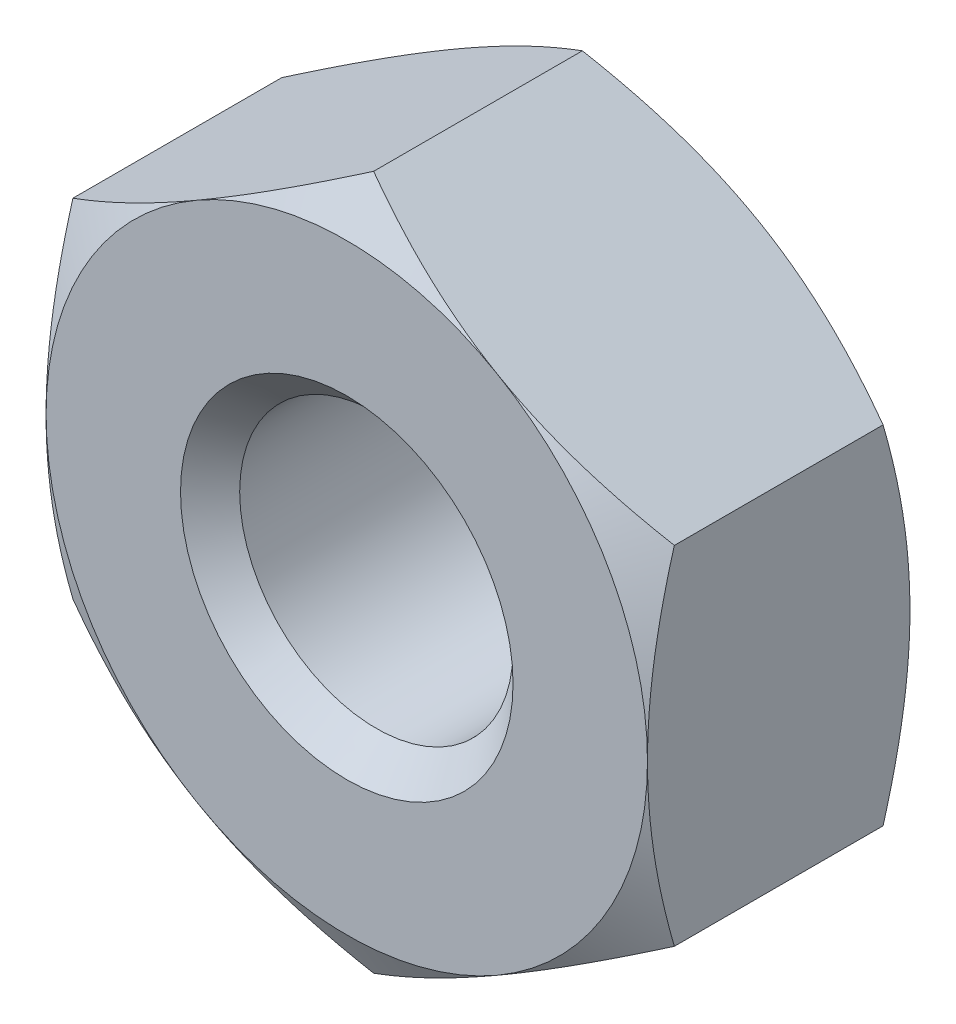
ISO-10303-21;
HEADER;
FILE_DESCRIPTION(('STEP AP214'),'2;1');
FILE_NAME('part.step','',(''),(''),'','','');
FILE_SCHEMA(('AUTOMOTIVE_DESIGN { 1 0 10303 214 1 1 1 1 }'));
ENDSEC;
DATA;
#1=APPLICATION_CONTEXT('core data for automotive mechanical design processes');
#2=APPLICATION_PROTOCOL_DEFINITION('international standard','automotive_design',2000,#1);
#3=PRODUCT_CONTEXT('',#1,'mechanical');
#4=PRODUCT('Part','Part','',(#3));
#5=PRODUCT_RELATED_PRODUCT_CATEGORY('part','',(#4));
#6=PRODUCT_DEFINITION_FORMATION('','',#4);
#7=PRODUCT_DEFINITION_CONTEXT('part definition',#1,'design');
#8=PRODUCT_DEFINITION('design','',#6,#7);
#9=PRODUCT_DEFINITION_SHAPE('','',#8);
#10=(LENGTH_UNIT() NAMED_UNIT(*) SI_UNIT(.MILLI.,.METRE.));
#11=(NAMED_UNIT(*) PLANE_ANGLE_UNIT() SI_UNIT($,.RADIAN.));
#12=(NAMED_UNIT(*) SI_UNIT($,.STERADIAN.) SOLID_ANGLE_UNIT());
#13=UNCERTAINTY_MEASURE_WITH_UNIT(LENGTH_MEASURE(1.E-05),#10,'distance_accuracy_value','');
#14=(GEOMETRIC_REPRESENTATION_CONTEXT(3) GLOBAL_UNCERTAINTY_ASSIGNED_CONTEXT((#13)) GLOBAL_UNIT_ASSIGNED_CONTEXT((#10,
#11,#12)) REPRESENTATION_CONTEXT('',''));
#15=CARTESIAN_POINT('',(0.,0.,0.));
#16=DIRECTION('',(0.,0.,1.));
#17=DIRECTION('',(1.,0.,0.));
#18=AXIS2_PLACEMENT_3D('',#15,#16,#17);
#19=CARTESIAN_POINT('',(0.,3.17542648054294,1.2));
#20=DIRECTION('',(0.5,-0.866025403784439,0.));
#21=DIRECTION('',(0.866025403784439,0.5,0.));
#22=AXIS2_PLACEMENT_3D('',#19,#20,#21);
#23=PLANE('',#22);
#24=CARTESIAN_POINT('',(0.000200000000000067,3.17554195059678,0.954313236635245));
#25=CARTESIAN_POINT('',(-0.120649220659906,3.10576962051743,0.994612337750741));
#26=CARTESIAN_POINT('',(-0.242541602622633,3.03539502097908,1.03126309740234));
#27=CARTESIAN_POINT('',(-0.488437126727892,2.89342717394439,1.0952378170302));
#28=CARTESIAN_POINT('',(-0.612444638573855,2.82183140359858,1.12253914432551));
#29=CARTESIAN_POINT('',(-0.858922797975943,2.67952717191842,1.16503825470589));
#30=CARTESIAN_POINT('',(-0.981355518587416,2.60884060771577,1.18051888137754));
#31=CARTESIAN_POINT('',(-1.22679714236891,2.46713482015519,1.19900060263006));
#32=CARTESIAN_POINT('',(-1.34980515323291,2.39611611197038,1.2020170005374));
#33=CARTESIAN_POINT('',(-1.57965878661079,2.26341005486544,1.19574685457145));
#34=CARTESIAN_POINT('',(-1.68653879125402,2.20170285541369,1.1879998457233));
#35=CARTESIAN_POINT('',(-1.89960246733475,2.07869048467395,1.16344481893565));
#36=CARTESIAN_POINT('',(-2.00578540164889,2.01738573896433,1.14662841034943));
#37=CARTESIAN_POINT('',(-2.21928848939318,1.89411967378235,1.10458807765405));
#38=CARTESIAN_POINT('',(-2.32658161614286,1.83217395817123,1.07918591931277));
#39=CARTESIAN_POINT('',(-2.53956747928405,1.70920651275308,1.02153277416002));
#40=CARTESIAN_POINT('',(-2.64526294502665,1.64818320715446,0.98929533670102));
#41=CARTESIAN_POINT('',(-2.7502,1.58759777021763,0.954313236635243));
#42=B_SPLINE_CURVE_WITH_KNOTS('',3,(#24,#25,#26,#27,#28,#29,#30,#31,#32,#33,#34,#35,#36,#37,#38,
#39,#40,#41),.UNSPECIFIED.,.F.,.F.,(4,2,2,2,2,2,2,2,4),(0.,0.435912828725888,0.872873557116331,
1.29901931904671,1.72464171213573,2.09526089052937,2.46622354066374,2.84541551798557,
3.22386274754524),.UNSPECIFIED.);
#43=CARTESIAN_POINT('',(0.,3.17542648054294,0.954379906938143));
#44=VERTEX_POINT('',#43);
#45=CARTESIAN_POINT('',(-1.375,2.38156986040721,1.2));
#46=VERTEX_POINT('',#45);
#47=EDGE_CURVE('E125',#44,#46,#42,.T.);
#48=ORIENTED_EDGE('',*,*,#47,.F.);
#49=DIRECTION('',(0.,0.,-1.));
#50=VECTOR('',#49,1.);
#51=CARTESIAN_POINT('',(0.,3.17542648054294,1.2));
#52=LINE('',#51,#50);
#53=CARTESIAN_POINT('',(0.,3.17542648054294,-0.954379906938143));
#54=VERTEX_POINT('',#53);
#55=EDGE_CURVE('E239',#44,#54,#52,.T.);
#56=ORIENTED_EDGE('',*,*,#55,.T.);
#57=CARTESIAN_POINT('',(-2.7502,1.58759777021763,-0.954313236635243));
#58=CARTESIAN_POINT('',(-2.6293507793401,1.65737010029699,-0.99461233775074));
#59=CARTESIAN_POINT('',(-2.50745839737737,1.72774469983533,-1.03126309740234));
#60=CARTESIAN_POINT('',(-2.26156287327211,1.86971254687003,-1.0952378170302));
#61=CARTESIAN_POINT('',(-2.13755536142615,1.94130831721583,-1.1225391443255));
#62=CARTESIAN_POINT('',(-1.89107720202406,2.08361254889599,-1.16503825470588));
#63=CARTESIAN_POINT('',(-1.76864448141259,2.15429911309864,-1.18051888137754));
#64=CARTESIAN_POINT('',(-1.52320285763109,2.29600490065923,-1.19900060263006));
#65=CARTESIAN_POINT('',(-1.40019484676709,2.36702360884404,-1.2020170005374));
#66=CARTESIAN_POINT('',(-1.17034121338921,2.49972966594897,-1.19574685457146));
#67=CARTESIAN_POINT('',(-1.06346120874598,2.56143686540072,-1.1879998457233));
#68=CARTESIAN_POINT('',(-0.850397532665252,2.68444923614046,-1.16344481893565));
#69=CARTESIAN_POINT('',(-0.744214598351113,2.74575398185008,-1.14662841034943));
#70=CARTESIAN_POINT('',(-0.530711510606817,2.86902004703206,-1.10458807765405));
#71=CARTESIAN_POINT('',(-0.423418383857146,2.93096576264318,-1.07918591931277));
#72=CARTESIAN_POINT('',(-0.210432520715949,3.05393320806134,-1.02153277416002));
#73=CARTESIAN_POINT('',(-0.104737054973348,3.11495651365995,-0.989295336701022));
#74=CARTESIAN_POINT('',(0.000199999999999903,3.17554195059678,-0.954313236635244));
#75=B_SPLINE_CURVE_WITH_KNOTS('',3,(#57,#58,#59,#60,#61,#62,#63,#64,#65,#66,#67,#68,#69,#70,#71,
#72,#73,#74),.UNSPECIFIED.,.F.,.F.,(4,2,2,2,2,2,2,2,4),(0.,0.435912828725888,0.872873557116332,
1.29901931904671,1.72464171213573,2.09526089052937,2.46622354066374,2.84541551798557,
3.22386274754524),.UNSPECIFIED.);
#76=CARTESIAN_POINT('',(-1.375,2.38156986040721,-1.2));
#77=VERTEX_POINT('',#76);
#78=EDGE_CURVE('E278',#77,#54,#75,.T.);
#79=ORIENTED_EDGE('',*,*,#78,.F.);
#80=CARTESIAN_POINT('',(-2.75,1.58771324027147,-0.954379906938141));
#81=VERTEX_POINT('',#80);
#82=EDGE_CURVE('E285',#81,#77,#75,.T.);
#83=ORIENTED_EDGE('',*,*,#82,.F.);
#84=DIRECTION('',(0.,0.,-1.));
#85=VECTOR('',#84,1.);
#86=CARTESIAN_POINT('',(-2.75,1.58771324027147,1.2));
#87=LINE('',#86,#85);
#88=CARTESIAN_POINT('',(-2.75,1.58771324027147,0.954379906938141));
#89=VERTEX_POINT('',#88);
#90=EDGE_CURVE('E153',#89,#81,#87,.T.);
#91=ORIENTED_EDGE('',*,*,#90,.F.);
#92=EDGE_CURVE('E135',#46,#89,#42,.T.);
#93=ORIENTED_EDGE('',*,*,#92,.F.);
#94=EDGE_LOOP('',(#48,#56,#79,#83,#91,#93));
#95=FACE_BOUND('',#94,.T.);
#96=ADVANCED_FACE('F37',(#95),#23,.F.);
#97=CARTESIAN_POINT('',(-2.75,1.58771324027147,1.2));
#98=DIRECTION('',(1.,0.,0.));
#99=DIRECTION('',(0.,0.,-1.));
#100=AXIS2_PLACEMENT_3D('',#97,#98,#99);
#101=PLANE('',#100);
#102=CARTESIAN_POINT('',(-2.75,-4.30390301720192,-0.161076408690709));
#103=CARTESIAN_POINT('',(-2.75,-4.18346183634496,-0.102495462412532));
#104=CARTESIAN_POINT('',(-2.75,-4.0627483469381,-0.0444649946513373));
#105=CARTESIAN_POINT('',(-2.75,-3.82063209362853,0.0701861633604315));
#106=CARTESIAN_POINT('',(-2.75,-3.69922922817248,0.126806638918857));
#107=CARTESIAN_POINT('',(-2.75,-3.45498258352431,0.238605553593725));
#108=CARTESIAN_POINT('',(-2.75,-3.33213458050091,0.293774796098297));
#109=CARTESIAN_POINT('',(-2.75,-3.08547511508691,0.401907353546585));
#110=CARTESIAN_POINT('',(-2.75,-2.9616636973982,0.454870770123538));
#111=CARTESIAN_POINT('',(-2.75,-2.70873002170802,0.559731360532049));
#112=CARTESIAN_POINT('',(-2.75,-2.57956837503753,0.611534033727881));
#113=CARTESIAN_POINT('',(-2.75,-2.31974843728962,0.711312632694245));
#114=CARTESIAN_POINT('',(-2.75,-2.18908998221528,0.759288134467373));
#115=CARTESIAN_POINT('',(-2.75,-1.92630078982448,0.850181497874872));
#116=CARTESIAN_POINT('',(-2.75,-1.79417351465773,0.893109270571312));
#117=CARTESIAN_POINT('',(-2.75,-1.52802381114163,0.972555534531259));
#118=CARTESIAN_POINT('',(-2.75,-1.39400198148718,1.00907600370378));
#119=CARTESIAN_POINT('',(-2.75,-1.1247426051988,1.07378343729295));
#120=CARTESIAN_POINT('',(-2.75,-0.98951651847669,1.10201722216622));
#121=CARTESIAN_POINT('',(-2.75,-0.717342133540144,1.14858513052455));
#122=CARTESIAN_POINT('',(-2.75,-0.580394010714915,1.16692025396294));
#123=CARTESIAN_POINT('',(-2.75,-0.307264223292112,1.19198982834036));
#124=CARTESIAN_POINT('',(-2.75,-0.171096876658298,1.19887642876326));
#125=CARTESIAN_POINT('',(-2.75,0.101336625313081,1.20086815686916));
#126=CARTESIAN_POINT('',(-2.75,0.237602781705956,1.19597315681277));
#127=CARTESIAN_POINT('',(-2.75,0.467797680560964,1.17810232782276));
#128=CARTESIAN_POINT('',(-2.75,0.561967915481139,1.1680452223586));
#129=CARTESIAN_POINT('',(-2.75,0.749642226834777,1.14290982744911));
#130=CARTESIAN_POINT('',(-2.75,0.843146215373774,1.12783088758256));
#131=CARTESIAN_POINT('',(-2.75,1.12250913895018,1.07584910895217));
#132=CARTESIAN_POINT('',(-2.75,1.30711940645803,1.03221009052051));
#133=CARTESIAN_POINT('',(-2.75,1.67667658210268,0.930598702582513));
#134=CARTESIAN_POINT('',(-2.75,1.86153763251216,0.87232596653366));
#135=CARTESIAN_POINT('',(-2.75,2.1362551669383,0.777677043706087));
#136=CARTESIAN_POINT('',(-2.75,2.2273905801987,0.74492404175435));
#137=CARTESIAN_POINT('',(-2.75,2.40890358977874,0.677382180856329));
#138=CARTESIAN_POINT('',(-2.75,2.49928119650105,0.642593349909013));
#139=CARTESIAN_POINT('',(-2.75,2.71825345258565,0.555929422896168));
#140=CARTESIAN_POINT('',(-2.75,2.84649489461499,0.503164300130228));
#141=CARTESIAN_POINT('',(-2.75,3.1018305499463,0.394920499569286));
#142=CARTESIAN_POINT('',(-2.75,3.22892468521528,0.33944163882475));
#143=CARTESIAN_POINT('',(-2.75,3.60884508520057,0.16980731720821));
#144=CARTESIAN_POINT('',(-2.75,3.86025161382976,0.0524776136911526));
#145=CARTESIAN_POINT('',(-2.75,4.36073216273561,-0.187701259786246));
#146=CARTESIAN_POINT('',(-2.75,4.60980322815241,-0.310556513491473));
#147=CARTESIAN_POINT('',(-2.75,5.10611636333848,-0.559922515280733));
#148=CARTESIAN_POINT('',(-2.75,5.35335836018192,-0.686433408140724));
#149=CARTESIAN_POINT('',(-2.75,5.82470677893949,-0.930706625425102));
#150=CARTESIAN_POINT('',(-2.75,6.04892545541808,-1.04825313857293));
#151=CARTESIAN_POINT('',(-2.75,6.49653363605935,-1.28493475206167));
#152=CARTESIAN_POINT('',(-2.75,6.71992310596418,-1.40406991712259));
#153=CARTESIAN_POINT('',(-2.75,7.1654482395454,-1.64321658337444));
#154=CARTESIAN_POINT('',(-2.75,7.38758566096615,-1.76322481484964));
#155=CARTESIAN_POINT('',(-2.75,7.83133346602344,-2.00418017005894));
#156=CARTESIAN_POINT('',(-2.75,8.05294388084433,-2.12512723633796));
#157=CARTESIAN_POINT('',(-2.75,8.27436218409939,-2.24642255294576));
#158=B_SPLINE_CURVE_WITH_KNOTS('',3,(#102,#103,#104,#105,#106,#107,#108,#109,#110,#111,#112,
#113,#114,#115,#116,#117,#118,#119,#120,#121,#122,#123,#124,#125,#126,#127,#128,#129,#130,#131,
#132,#133,#134,#135,#136,#137,#138,#139,#140,#141,#142,#143,#144,#145,#146,#147,#148,#149,#150,
#151,#152,#153,#154,#155,#156,#157),.UNSPECIFIED.,.F.,.F.,(4,2,2,2,2,2,2,2,2,2,2,2,2,2,2,2,2,2,
2,2,2,2,2,2,2,2,2,4),(0.,0.401800999438933,0.803662809496789,1.2076472715733,1.61161309946231,
2.02905420356356,2.44654149029695,2.86319485917833,3.27971938165075,3.69384308413964,
4.10792494441558,4.51645837884831,4.92499624273394,5.20897756068255,5.49299567382162,
6.06133052851013,6.64245100592872,6.93295892589162,7.22346285140748,7.63943779361214,
8.055440817965,8.88763374209439,9.72076650036463,10.5539322989188,11.31341213061,
12.0729229978166,12.8303656683841,13.5877623445881),.UNSPECIFIED.);
#159=CARTESIAN_POINT('',(-2.75,0.,1.2));
#160=VERTEX_POINT('',#159);
#161=EDGE_CURVE('E142',#89,#160,#158,.F.);
#162=ORIENTED_EDGE('',*,*,#161,.F.);
#163=ORIENTED_EDGE('',*,*,#90,.T.);
#164=CARTESIAN_POINT('',(-2.75,-4.30390301720192,0.161076408690709));
#165=CARTESIAN_POINT('',(-2.75,-4.18346183634496,0.102495462412532));
#166=CARTESIAN_POINT('',(-2.75,-4.0627483469381,0.0444649946513373));
#167=CARTESIAN_POINT('',(-2.75,-3.82063209362853,-0.0701861633604315));
#168=CARTESIAN_POINT('',(-2.75,-3.69922922817248,-0.126806638918857));
#169=CARTESIAN_POINT('',(-2.75,-3.45498258352431,-0.238605553593725));
#170=CARTESIAN_POINT('',(-2.75,-3.33213458050091,-0.293774796098297));
#171=CARTESIAN_POINT('',(-2.75,-3.08547511508691,-0.401907353546585));
#172=CARTESIAN_POINT('',(-2.75,-2.9616636973982,-0.454870770123538));
#173=CARTESIAN_POINT('',(-2.75,-2.70873002170802,-0.559731360532049));
#174=CARTESIAN_POINT('',(-2.75,-2.57956837503753,-0.611534033727881));
#175=CARTESIAN_POINT('',(-2.75,-2.31974843728962,-0.711312632694245));
#176=CARTESIAN_POINT('',(-2.75,-2.18908998221528,-0.759288134467373));
#177=CARTESIAN_POINT('',(-2.75,-1.92630078982448,-0.850181497874872));
#178=CARTESIAN_POINT('',(-2.75,-1.79417351465773,-0.893109270571312));
#179=CARTESIAN_POINT('',(-2.75,-1.52802381114163,-0.972555534531259));
#180=CARTESIAN_POINT('',(-2.75,-1.39400198148718,-1.00907600370378));
#181=CARTESIAN_POINT('',(-2.75,-1.1247426051988,-1.07378343729295));
#182=CARTESIAN_POINT('',(-2.75,-0.98951651847669,-1.10201722216622));
#183=CARTESIAN_POINT('',(-2.75,-0.717342133540144,-1.14858513052455));
#184=CARTESIAN_POINT('',(-2.75,-0.580394010714915,-1.16692025396294));
#185=CARTESIAN_POINT('',(-2.75,-0.307264223292112,-1.19198982834036));
#186=CARTESIAN_POINT('',(-2.75,-0.171096876658298,-1.19887642876326));
#187=CARTESIAN_POINT('',(-2.75,0.101336625313081,-1.20086815686916));
#188=CARTESIAN_POINT('',(-2.75,0.237602781705956,-1.19597315681277));
#189=CARTESIAN_POINT('',(-2.75,0.467797680560964,-1.17810232782276));
#190=CARTESIAN_POINT('',(-2.75,0.561967915481139,-1.1680452223586));
#191=CARTESIAN_POINT('',(-2.75,0.749642226834777,-1.14290982744911));
#192=CARTESIAN_POINT('',(-2.75,0.843146215373774,-1.12783088758256));
#193=CARTESIAN_POINT('',(-2.75,1.12250913895018,-1.07584910895217));
#194=CARTESIAN_POINT('',(-2.75,1.30711940645803,-1.03221009052051));
#195=CARTESIAN_POINT('',(-2.75,1.67667658210268,-0.930598702582513));
#196=CARTESIAN_POINT('',(-2.75,1.86153763251216,-0.87232596653366));
#197=CARTESIAN_POINT('',(-2.75,2.1362551669383,-0.777677043706087));
#198=CARTESIAN_POINT('',(-2.75,2.2273905801987,-0.74492404175435));
#199=CARTESIAN_POINT('',(-2.75,2.40890358977874,-0.677382180856329));
#200=CARTESIAN_POINT('',(-2.75,2.49928119650105,-0.642593349909013));
#201=CARTESIAN_POINT('',(-2.75,2.71825345258565,-0.555929422896168));
#202=CARTESIAN_POINT('',(-2.75,2.84649489461499,-0.503164300130228));
#203=CARTESIAN_POINT('',(-2.75,3.1018305499463,-0.394920499569286));
#204=CARTESIAN_POINT('',(-2.75,3.22892468521528,-0.33944163882475));
#205=CARTESIAN_POINT('',(-2.75,3.60884508520057,-0.16980731720821));
#206=CARTESIAN_POINT('',(-2.75,3.86025161382976,-0.0524776136911526));
#207=CARTESIAN_POINT('',(-2.75,4.36073216273561,0.187701259786246));
#208=CARTESIAN_POINT('',(-2.75,4.60980322815241,0.310556513491473));
#209=CARTESIAN_POINT('',(-2.75,5.10611636333848,0.559922515280733));
#210=CARTESIAN_POINT('',(-2.75,5.35335836018192,0.686433408140724));
#211=CARTESIAN_POINT('',(-2.75,5.82470677893949,0.930706625425102));
#212=CARTESIAN_POINT('',(-2.75,6.04892545541808,1.04825313857293));
#213=CARTESIAN_POINT('',(-2.75,6.49653363605935,1.28493475206167));
#214=CARTESIAN_POINT('',(-2.75,6.71992310596418,1.40406991712259));
#215=CARTESIAN_POINT('',(-2.75,7.1654482395454,1.64321658337444));
#216=CARTESIAN_POINT('',(-2.75,7.38758566096615,1.76322481484964));
#217=CARTESIAN_POINT('',(-2.75,7.83133346602344,2.00418017005894));
#218=CARTESIAN_POINT('',(-2.75,8.05294388084433,2.12512723633796));
#219=CARTESIAN_POINT('',(-2.75,8.27436218409939,2.24642255294576));
#220=B_SPLINE_CURVE_WITH_KNOTS('',3,(#164,#165,#166,#167,#168,#169,#170,#171,#172,#173,#174,
#175,#176,#177,#178,#179,#180,#181,#182,#183,#184,#185,#186,#187,#188,#189,#190,#191,#192,#193,
#194,#195,#196,#197,#198,#199,#200,#201,#202,#203,#204,#205,#206,#207,#208,#209,#210,#211,#212,
#213,#214,#215,#216,#217,#218,#219),.UNSPECIFIED.,.F.,.F.,(4,2,2,2,2,2,2,2,2,2,2,2,2,2,2,2,2,2,
2,2,2,2,2,2,2,2,2,4),(0.,0.401800999438933,0.803662809496789,1.2076472715733,1.61161309946231,
2.02905420356356,2.44654149029695,2.86319485917833,3.27971938165075,3.69384308413964,
4.10792494441558,4.51645837884831,4.92499624273394,5.20897756068255,5.49299567382162,
6.06133052851013,6.64245100592872,6.93295892589162,7.22346285140748,7.63943779361214,
8.055440817965,8.88763374209439,9.72076650036463,10.5539322989188,11.31341213061,
12.0729229978166,12.8303656683841,13.5877623445881),.UNSPECIFIED.);
#221=CARTESIAN_POINT('',(-2.75,0.,-1.2));
#222=VERTEX_POINT('',#221);
#223=EDGE_CURVE('E233',#222,#81,#220,.T.);
#224=ORIENTED_EDGE('',*,*,#223,.F.);
#225=CARTESIAN_POINT('',(-2.75,-1.58771324027169,-0.954379906938282));
#226=VERTEX_POINT('',#225);
#227=EDGE_CURVE('E297',#226,#222,#220,.T.);
#228=ORIENTED_EDGE('',*,*,#227,.F.);
#229=DIRECTION('',(0.,0.,-1.));
#230=VECTOR('',#229,1.);
#231=CARTESIAN_POINT('',(-2.75,-1.58771324027147,1.2));
#232=LINE('',#231,#230);
#233=CARTESIAN_POINT('',(-2.75,-1.58771324027147,0.95437990693814));
#234=VERTEX_POINT('',#233);
#235=EDGE_CURVE('E247',#234,#226,#232,.T.);
#236=ORIENTED_EDGE('',*,*,#235,.F.);
#237=EDGE_CURVE('E154',#160,#234,#158,.F.);
#238=ORIENTED_EDGE('',*,*,#237,.F.);
#239=EDGE_LOOP('',(#162,#163,#224,#228,#236,#238));
#240=FACE_BOUND('',#239,.T.);
#241=ADVANCED_FACE('F217',(#240),#101,.F.);
#242=CARTESIAN_POINT('',(-2.75,-1.58771324027147,1.2));
#243=DIRECTION('',(0.5,0.866025403784438,0.));
#244=DIRECTION('',(-0.866025403784439,0.5,0.));
#245=AXIS2_PLACEMENT_3D('',#242,#243,#244);
#246=PLANE('',#245);
#247=CARTESIAN_POINT('',(-2.7502,-1.58759777021764,0.954313236635242));
#248=CARTESIAN_POINT('',(-2.6293507793401,-1.65737010029699,0.994612337750739));
#249=CARTESIAN_POINT('',(-2.50745839737737,-1.72774469983533,1.03126309740234));
#250=CARTESIAN_POINT('',(-2.26156287327211,-1.86971254687003,1.0952378170302));
#251=CARTESIAN_POINT('',(-2.13755536142615,-1.94130831721583,1.1225391443255));
#252=CARTESIAN_POINT('',(-1.89107720202406,-2.08361254889599,1.16503825470588));
#253=CARTESIAN_POINT('',(-1.76864448141259,-2.15429911309864,1.18051888137754));
#254=CARTESIAN_POINT('',(-1.52320285763109,-2.29600490065923,1.19900060263006));
#255=CARTESIAN_POINT('',(-1.40019484676709,-2.36702360884404,1.2020170005374));
#256=CARTESIAN_POINT('',(-1.17034121338921,-2.49972966594897,1.19574685457145));
#257=CARTESIAN_POINT('',(-1.06346120874598,-2.56143686540073,1.1879998457233));
#258=CARTESIAN_POINT('',(-0.850397532665252,-2.68444923614047,1.16344481893564));
#259=CARTESIAN_POINT('',(-0.744214598351113,-2.74575398185008,1.14662841034943));
#260=CARTESIAN_POINT('',(-0.530711510606818,-2.86902004703207,1.10458807765404));
#261=CARTESIAN_POINT('',(-0.423418383857146,-2.93096576264319,1.07918591931277));
#262=CARTESIAN_POINT('',(-0.21043252071595,-3.05393320806134,1.02153277416002));
#263=CARTESIAN_POINT('',(-0.104737054973348,-3.11495651365996,0.989295336701018));
#264=CARTESIAN_POINT('',(0.000199999999999743,-3.17554195059679,0.954313236635241));
#265=B_SPLINE_CURVE_WITH_KNOTS('',3,(#247,#248,#249,#250,#251,#252,#253,#254,#255,#256,#257,
#258,#259,#260,#261,#262,#263,#264),.UNSPECIFIED.,.F.,.F.,(4,2,2,2,2,2,2,2,4),(0.,
0.435912828725888,0.872873557116332,1.29901931904672,1.72464171213574,2.09526089052938,
2.46622354066374,2.84541551798557,3.22386274754525),.UNSPECIFIED.);
#266=CARTESIAN_POINT('',(-1.375,-2.38156986040721,1.2));
#267=VERTEX_POINT('',#266);
#268=EDGE_CURVE('E211',#234,#267,#265,.T.);
#269=ORIENTED_EDGE('',*,*,#268,.F.);
#270=ORIENTED_EDGE('',*,*,#235,.T.);
#271=CARTESIAN_POINT('',(0.000199999999999867,-3.17554195059679,-0.954313236635241));
#272=CARTESIAN_POINT('',(-0.120649220659906,-3.10576962051743,-0.994612337750738));
#273=CARTESIAN_POINT('',(-0.242541602622634,-3.03539502097909,-1.03126309740234));
#274=CARTESIAN_POINT('',(-0.488437126727893,-2.89342717394439,-1.0952378170302));
#275=CARTESIAN_POINT('',(-0.612444638573856,-2.82183140359859,-1.1225391443255));
#276=CARTESIAN_POINT('',(-0.858922797975945,-2.67952717191843,-1.16503825470588));
#277=CARTESIAN_POINT('',(-0.981355518587418,-2.60884060771578,-1.18051888137754));
#278=CARTESIAN_POINT('',(-1.22679714236892,-2.46713482015519,-1.19900060263006));
#279=CARTESIAN_POINT('',(-1.34980515323291,-2.39611611197038,-1.2020170005374));
#280=CARTESIAN_POINT('',(-1.57965878661079,-2.26341005486545,-1.19574685457145));
#281=CARTESIAN_POINT('',(-1.68653879125402,-2.20170285541369,-1.1879998457233));
#282=CARTESIAN_POINT('',(-1.89960246733475,-2.07869048467395,-1.16344481893564));
#283=CARTESIAN_POINT('',(-2.00578540164889,-2.01738573896434,-1.14662841034943));
#284=CARTESIAN_POINT('',(-2.21928848939319,-1.89411967378235,-1.10458807765404));
#285=CARTESIAN_POINT('',(-2.32658161614286,-1.83217395817123,-1.07918591931277));
#286=CARTESIAN_POINT('',(-2.53956747928405,-1.70920651275308,-1.02153277416002));
#287=CARTESIAN_POINT('',(-2.64526294502665,-1.64818320715446,-0.989295336701019));
#288=CARTESIAN_POINT('',(-2.7502,-1.58759777021764,-0.954313236635242));
#289=B_SPLINE_CURVE_WITH_KNOTS('',3,(#271,#272,#273,#274,#275,#276,#277,#278,#279,#280,#281,
#282,#283,#284,#285,#286,#287,#288),.UNSPECIFIED.,.F.,.F.,(4,2,2,2,2,2,2,2,4),(0.,
0.435912828725888,0.872873557116332,1.29901931904672,1.72464171213574,2.09526089052938,
2.46622354066374,2.84541551798557,3.22386274754525),.UNSPECIFIED.);
#290=CARTESIAN_POINT('',(-1.375,-2.38156986040721,-1.2));
#291=VERTEX_POINT('',#290);
#292=EDGE_CURVE('E223',#291,#226,#289,.T.);
#293=ORIENTED_EDGE('',*,*,#292,.F.);
#294=CARTESIAN_POINT('',(0.,-3.17542648054295,-0.954379906938139));
#295=VERTEX_POINT('',#294);
#296=EDGE_CURVE('E231',#295,#291,#289,.T.);
#297=ORIENTED_EDGE('',*,*,#296,.F.);
#298=DIRECTION('',(0.,0.,-1.));
#299=VECTOR('',#298,1.);
#300=CARTESIAN_POINT('',(0.,-3.17542648054295,1.2));
#301=LINE('',#300,#299);
#302=CARTESIAN_POINT('',(0.,-3.17542648054295,0.954379906938139));
#303=VERTEX_POINT('',#302);
#304=EDGE_CURVE('E245',#303,#295,#301,.T.);
#305=ORIENTED_EDGE('',*,*,#304,.F.);
#306=EDGE_CURVE('E205',#267,#303,#265,.T.);
#307=ORIENTED_EDGE('',*,*,#306,.F.);
#308=EDGE_LOOP('',(#269,#270,#293,#297,#305,#307));
#309=FACE_BOUND('',#308,.T.);
#310=ADVANCED_FACE('F213',(#309),#246,.F.);
#311=CARTESIAN_POINT('',(0.,-3.17542648054295,1.2));
#312=DIRECTION('',(-0.500000000000001,0.866025403784438,0.));
#313=DIRECTION('',(-0.866025403784438,-0.500000000000001,0.));
#314=AXIS2_PLACEMENT_3D('',#311,#312,#313);
#315=PLANE('',#314);
#316=CARTESIAN_POINT('',(-0.000200000000000038,-3.17554195059679,0.954313236635241));
#317=CARTESIAN_POINT('',(0.120649220659906,-3.10576962051743,0.994612337750738));
#318=CARTESIAN_POINT('',(0.242541602622634,-3.03539502097909,1.03126309740234));
#319=CARTESIAN_POINT('',(0.488437126727893,-2.89342717394439,1.0952378170302));
#320=CARTESIAN_POINT('',(0.612444638573855,-2.82183140359859,1.1225391443255));
#321=CARTESIAN_POINT('',(0.858922797975944,-2.67952717191843,1.16503825470588));
#322=CARTESIAN_POINT('',(0.981355518587417,-2.60884060771578,1.18051888137754));
#323=CARTESIAN_POINT('',(1.22679714236892,-2.46713482015519,1.19900060263006));
#324=CARTESIAN_POINT('',(1.34980515323291,-2.39611611197038,1.2020170005374));
#325=CARTESIAN_POINT('',(1.57965878661079,-2.26341005486545,1.19574685457145));
#326=CARTESIAN_POINT('',(1.68653879125402,-2.20170285541369,1.1879998457233));
#327=CARTESIAN_POINT('',(1.89960246733475,-2.07869048467395,1.16344481893565));
#328=CARTESIAN_POINT('',(2.00578540164889,-2.01738573896434,1.14662841034943));
#329=CARTESIAN_POINT('',(2.21928848939318,-1.89411967378235,1.10458807765405));
#330=CARTESIAN_POINT('',(2.32658161614285,-1.83217395817123,1.07918591931277));
#331=CARTESIAN_POINT('',(2.53956747928405,-1.70920651275308,1.02153277416002));
#332=CARTESIAN_POINT('',(2.64526294502665,-1.64818320715447,0.989295336701021));
#333=CARTESIAN_POINT('',(2.7502,-1.58759777021764,0.954313236635244));
#334=B_SPLINE_CURVE_WITH_KNOTS('',3,(#316,#317,#318,#319,#320,#321,#322,#323,#324,#325,#326,
#327,#328,#329,#330,#331,#332,#333),.UNSPECIFIED.,.F.,.F.,(4,2,2,2,2,2,2,2,4),(0.,
0.435912828725888,0.872873557116332,1.29901931904672,1.72464171213574,2.09526089052938,
2.46622354066374,2.84541551798557,3.22386274754524),.UNSPECIFIED.);
#335=CARTESIAN_POINT('',(1.375,-2.38156986040721,1.2));
#336=VERTEX_POINT('',#335);
#337=EDGE_CURVE('E212',#303,#336,#334,.T.);
#338=ORIENTED_EDGE('',*,*,#337,.F.);
#339=ORIENTED_EDGE('',*,*,#304,.T.);
#340=CARTESIAN_POINT('',(2.7502,-1.58759777021764,-0.954313236635244));
#341=CARTESIAN_POINT('',(2.62935077934009,-1.65737010029699,-0.994612337750741));
#342=CARTESIAN_POINT('',(2.50745839737737,-1.72774469983533,-1.03126309740234));
#343=CARTESIAN_POINT('',(2.26156287327211,-1.86971254687003,-1.0952378170302));
#344=CARTESIAN_POINT('',(2.13755536142614,-1.94130831721583,-1.1225391443255));
#345=CARTESIAN_POINT('',(1.89107720202406,-2.08361254889599,-1.16503825470588));
#346=CARTESIAN_POINT('',(1.76864448141258,-2.15429911309864,-1.18051888137754));
#347=CARTESIAN_POINT('',(1.52320285763108,-2.29600490065923,-1.19900060263006));
#348=CARTESIAN_POINT('',(1.40019484676709,-2.36702360884404,-1.2020170005374));
#349=CARTESIAN_POINT('',(1.17034121338921,-2.49972966594897,-1.19574685457145));
#350=CARTESIAN_POINT('',(1.06346120874598,-2.56143686540073,-1.1879998457233));
#351=CARTESIAN_POINT('',(0.85039753266525,-2.68444923614047,-1.16344481893564));
#352=CARTESIAN_POINT('',(0.744214598351111,-2.74575398185008,-1.14662841034943));
#353=CARTESIAN_POINT('',(0.530711510606816,-2.86902004703207,-1.10458807765404));
#354=CARTESIAN_POINT('',(0.423418383857145,-2.93096576264319,-1.07918591931277));
#355=CARTESIAN_POINT('',(0.210432520715949,-3.05393320806134,-1.02153277416002));
#356=CARTESIAN_POINT('',(0.104737054973347,-3.11495651365996,-0.989295336701018));
#357=CARTESIAN_POINT('',(-0.000200000000000245,-3.17554195059679,-0.95431323663524));
#358=B_SPLINE_CURVE_WITH_KNOTS('',3,(#340,#341,#342,#343,#344,#345,#346,#347,#348,#349,#350,
#351,#352,#353,#354,#355,#356,#357),.UNSPECIFIED.,.F.,.F.,(4,2,2,2,2,2,2,2,4),(0.,
0.435912828725888,0.872873557116331,1.29901931904671,1.72464171213573,2.09526089052937,
2.46622354066374,2.84541551798557,3.22386274754524),.UNSPECIFIED.);
#359=CARTESIAN_POINT('',(1.375,-2.38156986040721,-1.2));
#360=VERTEX_POINT('',#359);
#361=EDGE_CURVE('E232',#360,#295,#358,.T.);
#362=ORIENTED_EDGE('',*,*,#361,.F.);
#363=CARTESIAN_POINT('',(2.75,-1.58771324027169,-0.954379906938284));
#364=VERTEX_POINT('',#363);
#365=EDGE_CURVE('E286',#364,#360,#358,.T.);
#366=ORIENTED_EDGE('',*,*,#365,.F.);
#367=DIRECTION('',(0.,0.,-1.));
#368=VECTOR('',#367,1.);
#369=CARTESIAN_POINT('',(2.75,-1.58771324027147,1.2));
#370=LINE('',#369,#368);
#371=CARTESIAN_POINT('',(2.75,-1.58771324027169,0.954379906938284));
#372=VERTEX_POINT('',#371);
#373=EDGE_CURVE('E243',#372,#364,#370,.T.);
#374=ORIENTED_EDGE('',*,*,#373,.F.);
#375=EDGE_CURVE('E199',#336,#372,#334,.T.);
#376=ORIENTED_EDGE('',*,*,#375,.F.);
#377=EDGE_LOOP('',(#338,#339,#362,#366,#374,#376));
#378=FACE_BOUND('',#377,.T.);
#379=ADVANCED_FACE('F216',(#378),#315,.F.);
#380=CARTESIAN_POINT('',(2.75,1.58771324027147,1.2));
#381=DIRECTION('',(-1.,0.,0.));
#382=DIRECTION('',(0.,0.,1.));
#383=AXIS2_PLACEMENT_3D('',#380,#381,#382);
#384=PLANE('',#383);
#385=CARTESIAN_POINT('',(2.75,-4.30390301720192,-0.161076408690707));
#386=CARTESIAN_POINT('',(2.75,-4.18346183634496,-0.10249546241253));
#387=CARTESIAN_POINT('',(2.75,-4.0627483469381,-0.0444649946513354));
#388=CARTESIAN_POINT('',(2.75,-3.82063209362853,0.0701861633604329));
#389=CARTESIAN_POINT('',(2.75,-3.69922922817248,0.126806638918858));
#390=CARTESIAN_POINT('',(2.75,-3.45498258352431,0.238605553593726));
#391=CARTESIAN_POINT('',(2.75,-3.33213458050091,0.293774796098298));
#392=CARTESIAN_POINT('',(2.75,-3.08547511508691,0.401907353546586));
#393=CARTESIAN_POINT('',(2.75,-2.9616636973982,0.454870770123539));
#394=CARTESIAN_POINT('',(2.75,-2.70873002170802,0.559731360532051));
#395=CARTESIAN_POINT('',(2.75,-2.57956837503753,0.611534033727882));
#396=CARTESIAN_POINT('',(2.75,-2.31974843728962,0.711312632694246));
#397=CARTESIAN_POINT('',(2.75,-2.18908998221529,0.759288134467374));
#398=CARTESIAN_POINT('',(2.75,-1.92630078982448,0.850181497874874));
#399=CARTESIAN_POINT('',(2.75,-1.79417351465773,0.893109270571313));
#400=CARTESIAN_POINT('',(2.75,-1.52802381114164,0.97255553453126));
#401=CARTESIAN_POINT('',(2.75,-1.39400198148719,1.00907600370379));
#402=CARTESIAN_POINT('',(2.75,-1.1247426051988,1.07378343729295));
#403=CARTESIAN_POINT('',(2.75,-0.989516518476692,1.10201722216623));
#404=CARTESIAN_POINT('',(2.75,-0.717342133540146,1.14858513052455));
#405=CARTESIAN_POINT('',(2.75,-0.580394010714917,1.16692025396294));
#406=CARTESIAN_POINT('',(2.75,-0.307264223292114,1.19198982834036));
#407=CARTESIAN_POINT('',(2.75,-0.1710968766583,1.19887642876326));
#408=CARTESIAN_POINT('',(2.75,0.10133662531308,1.20086815686916));
#409=CARTESIAN_POINT('',(2.75,0.237602781705954,1.19597315681277));
#410=CARTESIAN_POINT('',(2.75,0.467797680560962,1.17810232782276));
#411=CARTESIAN_POINT('',(2.75,0.561967915481136,1.1680452223586));
#412=CARTESIAN_POINT('',(2.75,0.749642226834775,1.14290982744911));
#413=CARTESIAN_POINT('',(2.75,0.843146215373771,1.12783088758256));
#414=CARTESIAN_POINT('',(2.75,1.12250913895018,1.07584910895217));
#415=CARTESIAN_POINT('',(2.75,1.30711940645803,1.03221009052051));
#416=CARTESIAN_POINT('',(2.75,1.67667658210268,0.930598702582516));
#417=CARTESIAN_POINT('',(2.75,1.86153763251216,0.872325966533663));
#418=CARTESIAN_POINT('',(2.75,2.1362551669383,0.77767704370609));
#419=CARTESIAN_POINT('',(2.75,2.22739058019869,0.744924041754353));
#420=CARTESIAN_POINT('',(2.75,2.40890358977874,0.677382180856333));
#421=CARTESIAN_POINT('',(2.75,2.49928119650104,0.642593349909017));
#422=CARTESIAN_POINT('',(2.75,2.71825345258564,0.555929422896172));
#423=CARTESIAN_POINT('',(2.75,2.84649489461498,0.503164300130232));
#424=CARTESIAN_POINT('',(2.75,3.10183054994629,0.39492049956929));
#425=CARTESIAN_POINT('',(2.75,3.22892468521527,0.339441638824753));
#426=CARTESIAN_POINT('',(2.75,3.60884508520057,0.169807317208212));
#427=CARTESIAN_POINT('',(2.75,3.86025161382976,0.0524776136911548));
#428=CARTESIAN_POINT('',(2.75,4.36073216273561,-0.187701259786244));
#429=CARTESIAN_POINT('',(2.75,4.60980322815241,-0.310556513491472));
#430=CARTESIAN_POINT('',(2.75,5.10611636333848,-0.559922515280732));
#431=CARTESIAN_POINT('',(2.75,5.35335836018192,-0.686433408140723));
#432=CARTESIAN_POINT('',(2.75,5.82470677893949,-0.930706625425101));
#433=CARTESIAN_POINT('',(2.75,6.04892545541808,-1.04825313857293));
#434=CARTESIAN_POINT('',(2.75,6.49653363605935,-1.28493475206167));
#435=CARTESIAN_POINT('',(2.75,6.71992310596418,-1.40406991712259));
#436=CARTESIAN_POINT('',(2.75,7.1654482395454,-1.64321658337444));
#437=CARTESIAN_POINT('',(2.75,7.38758566096615,-1.76322481484964));
#438=CARTESIAN_POINT('',(2.75,7.83133346602344,-2.00418017005893));
#439=CARTESIAN_POINT('',(2.75,8.05294388084433,-2.12512723633795));
#440=CARTESIAN_POINT('',(2.75,8.27436218409938,-2.24642255294575));
#441=B_SPLINE_CURVE_WITH_KNOTS('',3,(#385,#386,#387,#388,#389,#390,#391,#392,#393,#394,#395,
#396,#397,#398,#399,#400,#401,#402,#403,#404,#405,#406,#407,#408,#409,#410,#411,#412,#413,#414,
#415,#416,#417,#418,#419,#420,#421,#422,#423,#424,#425,#426,#427,#428,#429,#430,#431,#432,#433,
#434,#435,#436,#437,#438,#439,#440),.UNSPECIFIED.,.F.,.F.,(4,2,2,2,2,2,2,2,2,2,2,2,2,2,2,2,2,2,
2,2,2,2,2,2,2,2,2,4),(0.,0.401800999438931,0.803662809496787,1.20764727157329,1.61161309946231,
2.02905420356356,2.44654149029695,2.86319485917833,3.27971938165075,3.69384308413964,
4.10792494441558,4.51645837884831,4.92499624273394,5.20897756068255,5.49299567382162,
6.06133052851012,6.64245100592871,6.93295892589161,7.22346285140747,7.63943779361214,
8.05544081796499,8.88763374209439,9.72076650036463,10.5539322989188,11.31341213061,
12.0729229978166,12.8303656683841,13.5877623445881),.UNSPECIFIED.);
#442=CARTESIAN_POINT('',(2.75,0.,1.2));
#443=VERTEX_POINT('',#442);
#444=EDGE_CURVE('E347',#372,#443,#441,.T.);
#445=ORIENTED_EDGE('',*,*,#444,.F.);
#446=ORIENTED_EDGE('',*,*,#373,.T.);
#447=CARTESIAN_POINT('',(2.75,-4.30390301720192,0.161076408690707));
#448=CARTESIAN_POINT('',(2.75,-4.18346183634496,0.10249546241253));
#449=CARTESIAN_POINT('',(2.75,-4.0627483469381,0.0444649946513354));
#450=CARTESIAN_POINT('',(2.75,-3.82063209362853,-0.0701861633604329));
#451=CARTESIAN_POINT('',(2.75,-3.69922922817248,-0.126806638918858));
#452=CARTESIAN_POINT('',(2.75,-3.45498258352431,-0.238605553593726));
#453=CARTESIAN_POINT('',(2.75,-3.33213458050091,-0.293774796098298));
#454=CARTESIAN_POINT('',(2.75,-3.08547511508691,-0.401907353546586));
#455=CARTESIAN_POINT('',(2.75,-2.9616636973982,-0.454870770123539));
#456=CARTESIAN_POINT('',(2.75,-2.70873002170802,-0.559731360532051));
#457=CARTESIAN_POINT('',(2.75,-2.57956837503753,-0.611534033727882));
#458=CARTESIAN_POINT('',(2.75,-2.31974843728962,-0.711312632694246));
#459=CARTESIAN_POINT('',(2.75,-2.18908998221529,-0.759288134467374));
#460=CARTESIAN_POINT('',(2.75,-1.92630078982448,-0.850181497874874));
#461=CARTESIAN_POINT('',(2.75,-1.79417351465773,-0.893109270571313));
#462=CARTESIAN_POINT('',(2.75,-1.52802381114164,-0.97255553453126));
#463=CARTESIAN_POINT('',(2.75,-1.39400198148719,-1.00907600370379));
#464=CARTESIAN_POINT('',(2.75,-1.1247426051988,-1.07378343729295));
#465=CARTESIAN_POINT('',(2.75,-0.989516518476692,-1.10201722216623));
#466=CARTESIAN_POINT('',(2.75,-0.717342133540146,-1.14858513052455));
#467=CARTESIAN_POINT('',(2.75,-0.580394010714917,-1.16692025396294));
#468=CARTESIAN_POINT('',(2.75,-0.307264223292114,-1.19198982834036));
#469=CARTESIAN_POINT('',(2.75,-0.1710968766583,-1.19887642876326));
#470=CARTESIAN_POINT('',(2.75,0.10133662531308,-1.20086815686916));
#471=CARTESIAN_POINT('',(2.75,0.237602781705954,-1.19597315681277));
#472=CARTESIAN_POINT('',(2.75,0.467797680560962,-1.17810232782276));
#473=CARTESIAN_POINT('',(2.75,0.561967915481136,-1.1680452223586));
#474=CARTESIAN_POINT('',(2.75,0.749642226834775,-1.14290982744911));
#475=CARTESIAN_POINT('',(2.75,0.843146215373771,-1.12783088758256));
#476=CARTESIAN_POINT('',(2.75,1.12250913895018,-1.07584910895217));
#477=CARTESIAN_POINT('',(2.75,1.30711940645803,-1.03221009052051));
#478=CARTESIAN_POINT('',(2.75,1.67667658210268,-0.930598702582516));
#479=CARTESIAN_POINT('',(2.75,1.86153763251216,-0.872325966533663));
#480=CARTESIAN_POINT('',(2.75,2.1362551669383,-0.77767704370609));
#481=CARTESIAN_POINT('',(2.75,2.22739058019869,-0.744924041754353));
#482=CARTESIAN_POINT('',(2.75,2.40890358977874,-0.677382180856333));
#483=CARTESIAN_POINT('',(2.75,2.49928119650104,-0.642593349909017));
#484=CARTESIAN_POINT('',(2.75,2.71825345258564,-0.555929422896172));
#485=CARTESIAN_POINT('',(2.75,2.84649489461498,-0.503164300130232));
#486=CARTESIAN_POINT('',(2.75,3.10183054994629,-0.39492049956929));
#487=CARTESIAN_POINT('',(2.75,3.22892468521527,-0.339441638824753));
#488=CARTESIAN_POINT('',(2.75,3.60884508520057,-0.169807317208212));
#489=CARTESIAN_POINT('',(2.75,3.86025161382976,-0.0524776136911548));
#490=CARTESIAN_POINT('',(2.75,4.36073216273561,0.187701259786244));
#491=CARTESIAN_POINT('',(2.75,4.60980322815241,0.310556513491472));
#492=CARTESIAN_POINT('',(2.75,5.10611636333848,0.559922515280732));
#493=CARTESIAN_POINT('',(2.75,5.35335836018192,0.686433408140723));
#494=CARTESIAN_POINT('',(2.75,5.82470677893949,0.930706625425101));
#495=CARTESIAN_POINT('',(2.75,6.04892545541808,1.04825313857293));
#496=CARTESIAN_POINT('',(2.75,6.49653363605935,1.28493475206167));
#497=CARTESIAN_POINT('',(2.75,6.71992310596418,1.40406991712259));
#498=CARTESIAN_POINT('',(2.75,7.1654482395454,1.64321658337444));
#499=CARTESIAN_POINT('',(2.75,7.38758566096615,1.76322481484964));
#500=CARTESIAN_POINT('',(2.75,7.83133346602344,2.00418017005893));
#501=CARTESIAN_POINT('',(2.75,8.05294388084433,2.12512723633795));
#502=CARTESIAN_POINT('',(2.75,8.27436218409938,2.24642255294575));
#503=B_SPLINE_CURVE_WITH_KNOTS('',3,(#447,#448,#449,#450,#451,#452,#453,#454,#455,#456,#457,
#458,#459,#460,#461,#462,#463,#464,#465,#466,#467,#468,#469,#470,#471,#472,#473,#474,#475,#476,
#477,#478,#479,#480,#481,#482,#483,#484,#485,#486,#487,#488,#489,#490,#491,#492,#493,#494,#495,
#496,#497,#498,#499,#500,#501,#502),.UNSPECIFIED.,.F.,.F.,(4,2,2,2,2,2,2,2,2,2,2,2,2,2,2,2,2,2,
2,2,2,2,2,2,2,2,2,4),(0.,0.401800999438931,0.803662809496787,1.20764727157329,1.61161309946231,
2.02905420356356,2.44654149029695,2.86319485917833,3.27971938165075,3.69384308413964,
4.10792494441558,4.51645837884831,4.92499624273394,5.20897756068255,5.49299567382162,
6.06133052851012,6.64245100592871,6.93295892589161,7.22346285140747,7.63943779361214,
8.05544081796499,8.88763374209439,9.72076650036463,10.5539322989188,11.31341213061,
12.0729229978166,12.8303656683841,13.5877623445881),.UNSPECIFIED.);
#504=CARTESIAN_POINT('',(2.75,0.,-1.2));
#505=VERTEX_POINT('',#504);
#506=EDGE_CURVE('E279',#505,#364,#503,.F.);
#507=ORIENTED_EDGE('',*,*,#506,.F.);
#508=CARTESIAN_POINT('',(2.75,1.58771324027147,-0.954379906938143));
#509=VERTEX_POINT('',#508);
#510=EDGE_CURVE('E271',#509,#505,#503,.F.);
#511=ORIENTED_EDGE('',*,*,#510,.F.);
#512=DIRECTION('',(0.,0.,-1.));
#513=VECTOR('',#512,1.);
#514=CARTESIAN_POINT('',(2.75,1.58771324027147,1.2));
#515=LINE('',#514,#513);
#516=CARTESIAN_POINT('',(2.75,1.58771324027147,0.954379906938143));
#517=VERTEX_POINT('',#516);
#518=EDGE_CURVE('E241',#517,#509,#515,.T.);
#519=ORIENTED_EDGE('',*,*,#518,.F.);
#520=EDGE_CURVE('E191',#443,#517,#441,.T.);
#521=ORIENTED_EDGE('',*,*,#520,.F.);
#522=EDGE_LOOP('',(#445,#446,#507,#511,#519,#521));
#523=FACE_BOUND('',#522,.T.);
#524=ADVANCED_FACE('F262',(#523),#384,.F.);
#525=CARTESIAN_POINT('',(2.75,1.58771324027147,1.2));
#526=DIRECTION('',(-0.5,-0.866025403784439,0.));
#527=DIRECTION('',(0.866025403784439,-0.5,0.));
#528=AXIS2_PLACEMENT_3D('',#525,#526,#527);
#529=PLANE('',#528);
#530=CARTESIAN_POINT('',(2.7502,1.58759777021763,0.954313236635245));
#531=CARTESIAN_POINT('',(2.62935077934009,1.65737010029699,0.994612337750741));
#532=CARTESIAN_POINT('',(2.50745839737737,1.72774469983533,1.03126309740234));
#533=CARTESIAN_POINT('',(2.26156287327211,1.86971254687003,1.0952378170302));
#534=CARTESIAN_POINT('',(2.13755536142614,1.94130831721583,1.12253914432551));
#535=CARTESIAN_POINT('',(1.89107720202406,2.08361254889599,1.16503825470589));
#536=CARTESIAN_POINT('',(1.76864448141258,2.15429911309864,1.18051888137754));
#537=CARTESIAN_POINT('',(1.52320285763109,2.29600490065923,1.19900060263006));
#538=CARTESIAN_POINT('',(1.40019484676709,2.36702360884404,1.2020170005374));
#539=CARTESIAN_POINT('',(1.17034121338921,2.49972966594897,1.19574685457146));
#540=CARTESIAN_POINT('',(1.06346120874598,2.56143686540073,1.1879998457233));
#541=CARTESIAN_POINT('',(0.850397532665251,2.68444923614046,1.16344481893565));
#542=CARTESIAN_POINT('',(0.744214598351112,2.74575398185008,1.14662841034943));
#543=CARTESIAN_POINT('',(0.530711510606817,2.86902004703206,1.10458807765405));
#544=CARTESIAN_POINT('',(0.423418383857146,2.93096576264318,1.07918591931277));
#545=CARTESIAN_POINT('',(0.210432520715949,3.05393320806134,1.02153277416002));
#546=CARTESIAN_POINT('',(0.104737054973348,3.11495651365995,0.989295336701022));
#547=CARTESIAN_POINT('',(-0.000199999999999916,3.17554195059678,0.954313236635244));
#548=B_SPLINE_CURVE_WITH_KNOTS('',3,(#530,#531,#532,#533,#534,#535,#536,#537,#538,#539,#540,
#541,#542,#543,#544,#545,#546,#547),.UNSPECIFIED.,.F.,.F.,(4,2,2,2,2,2,2,2,4),(0.,
0.435912828725887,0.87287355711633,1.29901931904671,1.72464171213573,2.09526089052937,
2.46622354066374,2.84541551798557,3.22386274754524),.UNSPECIFIED.);
#549=CARTESIAN_POINT('',(1.375,2.38156986040721,1.2));
#550=VERTEX_POINT('',#549);
#551=EDGE_CURVE('E350',#517,#550,#548,.T.);
#552=ORIENTED_EDGE('',*,*,#551,.F.);
#553=ORIENTED_EDGE('',*,*,#518,.T.);
#554=CARTESIAN_POINT('',(-0.0002,3.17554195059678,-0.954313236635244));
#555=CARTESIAN_POINT('',(0.120649220659906,3.10576962051743,-0.994612337750741));
#556=CARTESIAN_POINT('',(0.242541602622634,3.03539502097908,-1.03126309740234));
#557=CARTESIAN_POINT('',(0.488437126727892,2.89342717394439,-1.0952378170302));
#558=CARTESIAN_POINT('',(0.612444638573855,2.82183140359858,-1.12253914432551));
#559=CARTESIAN_POINT('',(0.858922797975943,2.67952717191842,-1.16503825470589));
#560=CARTESIAN_POINT('',(0.981355518587416,2.60884060771577,-1.18051888137754));
#561=CARTESIAN_POINT('',(1.22679714236891,2.46713482015518,-1.19900060263006));
#562=CARTESIAN_POINT('',(1.34980515323291,2.39611611197038,-1.2020170005374));
#563=CARTESIAN_POINT('',(1.57965878661079,2.26341005486544,-1.19574685457146));
#564=CARTESIAN_POINT('',(1.68653879125402,2.20170285541369,-1.1879998457233));
#565=CARTESIAN_POINT('',(1.89960246733475,2.07869048467395,-1.16344481893565));
#566=CARTESIAN_POINT('',(2.00578540164889,2.01738573896433,-1.14662841034943));
#567=CARTESIAN_POINT('',(2.21928848939318,1.89411967378235,-1.10458807765405));
#568=CARTESIAN_POINT('',(2.32658161614285,1.83217395817123,-1.07918591931277));
#569=CARTESIAN_POINT('',(2.53956747928405,1.70920651275308,-1.02153277416002));
#570=CARTESIAN_POINT('',(2.64526294502665,1.64818320715446,-0.989295336701022));
#571=CARTESIAN_POINT('',(2.7502,1.58759777021763,-0.954313236635245));
#572=B_SPLINE_CURVE_WITH_KNOTS('',3,(#554,#555,#556,#557,#558,#559,#560,#561,#562,#563,#564,
#565,#566,#567,#568,#569,#570,#571),.UNSPECIFIED.,.F.,.F.,(4,2,2,2,2,2,2,2,4),(0.,
0.435912828725888,0.872873557116331,1.29901931904671,1.72464171213573,2.09526089052937,
2.46622354066374,2.84541551798557,3.22386274754524),.UNSPECIFIED.);
#573=CARTESIAN_POINT('',(1.375,2.38156986040721,-1.2));
#574=VERTEX_POINT('',#573);
#575=EDGE_CURVE('E250',#574,#509,#572,.T.);
#576=ORIENTED_EDGE('',*,*,#575,.F.);
#577=EDGE_CURVE('E256',#54,#574,#572,.T.);
#578=ORIENTED_EDGE('',*,*,#577,.F.);
#579=ORIENTED_EDGE('',*,*,#55,.F.);
#580=EDGE_CURVE('E130',#550,#44,#548,.T.);
#581=ORIENTED_EDGE('',*,*,#580,.F.);
#582=EDGE_LOOP('',(#552,#553,#576,#578,#579,#581));
#583=FACE_BOUND('',#582,.T.);
#584=ADVANCED_FACE('F258',(#583),#529,.F.);
#585=CARTESIAN_POINT('',(0.,0.,1.2));
#586=DIRECTION('',(0.,0.,1.));
#587=DIRECTION('',(1.,0.,0.));
#588=AXIS2_PLACEMENT_3D('',#585,#586,#587);
#589=PLANE('',#588);
#590=CARTESIAN_POINT('',(0.,0.,1.2));
#591=DIRECTION('',(0.,0.,1.));
#592=DIRECTION('',(1.,0.,0.));
#593=AXIS2_PLACEMENT_3D('',#590,#591,#592);
#594=CIRCLE('',#593,1.5205);
#595=CARTESIAN_POINT('',(1.5205,0.,1.2));
#596=VERTEX_POINT('',#595);
#597=EDGE_CURVE('E11',#596,#596,#594,.F.);
#598=ORIENTED_EDGE('',*,*,#597,.T.);
#599=EDGE_LOOP('',(#598));
#600=FACE_BOUND('',#599,.T.);
#601=CARTESIAN_POINT('',(0.,0.,1.2));
#602=DIRECTION('',(0.,0.,1.));
#603=DIRECTION('',(1.,0.,0.));
#604=AXIS2_PLACEMENT_3D('',#601,#602,#603);
#605=CIRCLE('',#604,2.75);
#606=EDGE_CURVE('E150',#336,#443,#605,.T.);
#607=ORIENTED_EDGE('',*,*,#606,.T.);
#608=CARTESIAN_POINT('',(0.,0.,1.2));
#609=DIRECTION('',(0.,0.,1.));
#610=DIRECTION('',(1.,0.,0.));
#611=AXIS2_PLACEMENT_3D('',#608,#609,#610);
#612=CIRCLE('',#611,2.75);
#613=EDGE_CURVE('E52',#443,#550,#612,.T.);
#614=ORIENTED_EDGE('',*,*,#613,.T.);
#615=EDGE_CURVE('E128',#550,#46,#605,.T.);
#616=ORIENTED_EDGE('',*,*,#615,.T.);
#617=EDGE_CURVE('E139',#46,#160,#605,.T.);
#618=ORIENTED_EDGE('',*,*,#617,.T.);
#619=EDGE_CURVE('E146',#160,#267,#605,.T.);
#620=ORIENTED_EDGE('',*,*,#619,.T.);
#621=EDGE_CURVE('E332',#267,#336,#605,.T.);
#622=ORIENTED_EDGE('',*,*,#621,.T.);
#623=EDGE_LOOP('',(#607,#614,#616,#618,#620,#622));
#624=FACE_BOUND('',#623,.T.);
#625=ADVANCED_FACE('F148',(#600,#624),#589,.T.);
#626=CARTESIAN_POINT('',(0.,0.,-1.2));
#627=DIRECTION('',(0.,0.,1.));
#628=DIRECTION('',(1.,0.,0.));
#629=AXIS2_PLACEMENT_3D('',#626,#627,#628);
#630=PLANE('',#629);
#631=CARTESIAN_POINT('',(0.,0.,-1.2));
#632=DIRECTION('',(0.,0.,1.));
#633=DIRECTION('',(1.,0.,0.));
#634=AXIS2_PLACEMENT_3D('',#631,#632,#633);
#635=CIRCLE('',#634,1.5205);
#636=CARTESIAN_POINT('',(1.5205,0.,-1.2));
#637=VERTEX_POINT('',#636);
#638=EDGE_CURVE('E149',#637,#637,#635,.T.);
#639=ORIENTED_EDGE('',*,*,#638,.T.);
#640=EDGE_LOOP('',(#639));
#641=FACE_BOUND('',#640,.T.);
#642=CARTESIAN_POINT('',(0.,0.,-1.2));
#643=DIRECTION('',(0.,0.,1.));
#644=DIRECTION('',(1.,0.,0.));
#645=AXIS2_PLACEMENT_3D('',#642,#643,#644);
#646=CIRCLE('',#645,2.75);
#647=EDGE_CURVE('E169',#505,#574,#646,.T.);
#648=ORIENTED_EDGE('',*,*,#647,.F.);
#649=EDGE_CURVE('E134',#360,#505,#646,.T.);
#650=ORIENTED_EDGE('',*,*,#649,.F.);
#651=EDGE_CURVE('E321',#291,#360,#646,.T.);
#652=ORIENTED_EDGE('',*,*,#651,.F.);
#653=EDGE_CURVE('E308',#222,#291,#646,.T.);
#654=ORIENTED_EDGE('',*,*,#653,.F.);
#655=EDGE_CURVE('E319',#77,#222,#646,.T.);
#656=ORIENTED_EDGE('',*,*,#655,.F.);
#657=EDGE_CURVE('E322',#574,#77,#646,.T.);
#658=ORIENTED_EDGE('',*,*,#657,.F.);
#659=EDGE_LOOP('',(#648,#650,#652,#654,#656,#658));
#660=FACE_BOUND('',#659,.T.);
#661=ADVANCED_FACE('F264',(#641,#660),#630,.F.);
#662=CARTESIAN_POINT('',(0.,0.,1.2));
#663=DIRECTION('',(0.,0.,-1.));
#664=DIRECTION('',(-1.,0.,0.));
#665=AXIS2_PLACEMENT_3D('',#662,#663,#664);
#666=CYLINDRICAL_SURFACE('',#665,1.25);
#667=CARTESIAN_POINT('',(0.,0.,-0.929499999999999));
#668=DIRECTION('',(0.,0.,1.));
#669=DIRECTION('',(1.,0.,0.));
#670=AXIS2_PLACEMENT_3D('',#667,#668,#669);
#671=CIRCLE('',#670,1.25);
#672=CARTESIAN_POINT('',(1.25,0.,-0.929499999999999));
#673=VERTEX_POINT('',#672);
#674=EDGE_CURVE('E45',#673,#673,#671,.F.);
#675=ORIENTED_EDGE('',*,*,#674,.T.);
#676=EDGE_LOOP('',(#675));
#677=FACE_BOUND('',#676,.T.);
#678=CARTESIAN_POINT('',(0.,0.,0.929499999999999));
#679=DIRECTION('',(0.,0.,1.));
#680=DIRECTION('',(1.,0.,0.));
#681=AXIS2_PLACEMENT_3D('',#678,#679,#680);
#682=CIRCLE('',#681,1.25);
#683=CARTESIAN_POINT('',(1.25,0.,0.929499999999999));
#684=VERTEX_POINT('',#683);
#685=EDGE_CURVE('E438',#684,#684,#682,.T.);
#686=ORIENTED_EDGE('',*,*,#685,.T.);
#687=EDGE_LOOP('',(#686));
#688=FACE_BOUND('',#687,.T.);
#689=ADVANCED_FACE('F356',(#677,#688),#666,.F.);
#690=CARTESIAN_POINT('',(0.,0.,-0.288559800326557));
#691=DIRECTION('',(0.,0.,1.));
#692=DIRECTION('',(1.,0.,0.));
#693=AXIS2_PLACEMENT_3D('',#690,#691,#692);
#694=CONICAL_SURFACE('',#693,4.32866073389515,1.0471975511966);
#695=ORIENTED_EDGE('',*,*,#510,.T.);
#696=ORIENTED_EDGE('',*,*,#647,.T.);
#697=ORIENTED_EDGE('',*,*,#575,.T.);
#698=EDGE_LOOP('',(#695,#696,#697));
#699=FACE_BOUND('',#698,.T.);
#700=ADVANCED_FACE('F354',(#699),#694,.T.);
#701=ORIENTED_EDGE('',*,*,#78,.T.);
#702=ORIENTED_EDGE('',*,*,#577,.T.);
#703=ORIENTED_EDGE('',*,*,#657,.T.);
#704=EDGE_LOOP('',(#701,#702,#703));
#705=FACE_BOUND('',#704,.T.);
#706=ADVANCED_FACE('F327',(#705),#694,.T.);
#707=ORIENTED_EDGE('',*,*,#365,.T.);
#708=ORIENTED_EDGE('',*,*,#649,.T.);
#709=ORIENTED_EDGE('',*,*,#506,.T.);
#710=EDGE_LOOP('',(#707,#708,#709));
#711=FACE_BOUND('',#710,.T.);
#712=ADVANCED_FACE('F361',(#711),#694,.T.);
#713=ORIENTED_EDGE('',*,*,#296,.T.);
#714=ORIENTED_EDGE('',*,*,#651,.T.);
#715=ORIENTED_EDGE('',*,*,#361,.T.);
#716=EDGE_LOOP('',(#713,#714,#715));
#717=FACE_BOUND('',#716,.T.);
#718=ADVANCED_FACE('F176',(#717),#694,.T.);
#719=ORIENTED_EDGE('',*,*,#292,.T.);
#720=ORIENTED_EDGE('',*,*,#227,.T.);
#721=ORIENTED_EDGE('',*,*,#653,.T.);
#722=EDGE_LOOP('',(#719,#720,#721));
#723=FACE_BOUND('',#722,.T.);
#724=ADVANCED_FACE('F306',(#723),#694,.T.);
#725=ORIENTED_EDGE('',*,*,#223,.T.);
#726=ORIENTED_EDGE('',*,*,#82,.T.);
#727=ORIENTED_EDGE('',*,*,#655,.T.);
#728=EDGE_LOOP('',(#725,#726,#727));
#729=FACE_BOUND('',#728,.T.);
#730=ADVANCED_FACE('F330',(#729),#694,.T.);
#731=CARTESIAN_POINT('',(0.,0.,0.288559800326557));
#732=DIRECTION('',(0.,0.,-1.));
#733=DIRECTION('',(1.,0.,0.));
#734=AXIS2_PLACEMENT_3D('',#731,#732,#733);
#735=CONICAL_SURFACE('',#734,4.32866073389515,1.0471975511966);
#736=ORIENTED_EDGE('',*,*,#375,.T.);
#737=ORIENTED_EDGE('',*,*,#444,.T.);
#738=ORIENTED_EDGE('',*,*,#606,.F.);
#739=EDGE_LOOP('',(#736,#737,#738));
#740=FACE_BOUND('',#739,.T.);
#741=ADVANCED_FACE('F447',(#740),#735,.T.);
#742=ORIENTED_EDGE('',*,*,#306,.T.);
#743=ORIENTED_EDGE('',*,*,#337,.T.);
#744=ORIENTED_EDGE('',*,*,#621,.F.);
#745=EDGE_LOOP('',(#742,#743,#744));
#746=FACE_BOUND('',#745,.T.);
#747=ADVANCED_FACE('F344',(#746),#735,.T.);
#748=ORIENTED_EDGE('',*,*,#237,.T.);
#749=ORIENTED_EDGE('',*,*,#268,.T.);
#750=ORIENTED_EDGE('',*,*,#619,.F.);
#751=EDGE_LOOP('',(#748,#749,#750));
#752=FACE_BOUND('',#751,.T.);
#753=ADVANCED_FACE('F457',(#752),#735,.T.);
#754=ORIENTED_EDGE('',*,*,#92,.T.);
#755=ORIENTED_EDGE('',*,*,#161,.T.);
#756=ORIENTED_EDGE('',*,*,#617,.F.);
#757=EDGE_LOOP('',(#754,#755,#756));
#758=FACE_BOUND('',#757,.T.);
#759=ADVANCED_FACE('F140',(#758),#735,.T.);
#760=ORIENTED_EDGE('',*,*,#47,.T.);
#761=ORIENTED_EDGE('',*,*,#615,.F.);
#762=ORIENTED_EDGE('',*,*,#580,.T.);
#763=EDGE_LOOP('',(#760,#761,#762));
#764=FACE_BOUND('',#763,.T.);
#765=ADVANCED_FACE('F127',(#764),#735,.T.);
#766=ORIENTED_EDGE('',*,*,#520,.T.);
#767=ORIENTED_EDGE('',*,*,#551,.T.);
#768=ORIENTED_EDGE('',*,*,#613,.F.);
#769=EDGE_LOOP('',(#766,#767,#768));
#770=FACE_BOUND('',#769,.T.);
#771=ADVANCED_FACE('F175',(#770),#735,.T.);
#772=CARTESIAN_POINT('',(0.,0.,-1.2));
#773=DIRECTION('',(0.,0.,-1.));
#774=DIRECTION('',(-1.,0.,0.));
#775=AXIS2_PLACEMENT_3D('',#772,#773,#774);
#776=CONICAL_SURFACE('',#775,1.5205,0.785398163397447);
#777=ORIENTED_EDGE('',*,*,#674,.F.);
#778=EDGE_LOOP('',(#777));
#779=FACE_BOUND('',#778,.T.);
#780=ORIENTED_EDGE('',*,*,#638,.F.);
#781=EDGE_LOOP('',(#780));
#782=FACE_BOUND('',#781,.T.);
#783=ADVANCED_FACE('F416',(#779,#782),#776,.F.);
#784=CARTESIAN_POINT('',(0.,0.,0.929499999999999));
#785=DIRECTION('',(0.,0.,1.));
#786=DIRECTION('',(1.,0.,0.));
#787=AXIS2_PLACEMENT_3D('',#784,#785,#786);
#788=CONICAL_SURFACE('',#787,1.25,0.785398163397451);
#789=ORIENTED_EDGE('',*,*,#597,.F.);
#790=EDGE_LOOP('',(#789));
#791=FACE_BOUND('',#790,.T.);
#792=ORIENTED_EDGE('',*,*,#685,.F.);
#793=EDGE_LOOP('',(#792));
#794=FACE_BOUND('',#793,.T.);
#795=ADVANCED_FACE('F39',(#791,#794),#788,.F.);
#796=CLOSED_SHELL('',(#96,#241,#310,#379,#524,#584,#625,#661,#689,#700,#706,#712,#718,#724,#730,
#741,#747,#753,#759,#765,#771,#783,#795));
#797=MANIFOLD_SOLID_BREP('B2',#796);
#798=ADVANCED_BREP_SHAPE_REPRESENTATION('',(#18,#797),#14);
#799=SHAPE_DEFINITION_REPRESENTATION(#9,#798);
ENDSEC;
END-ISO-10303-21;
